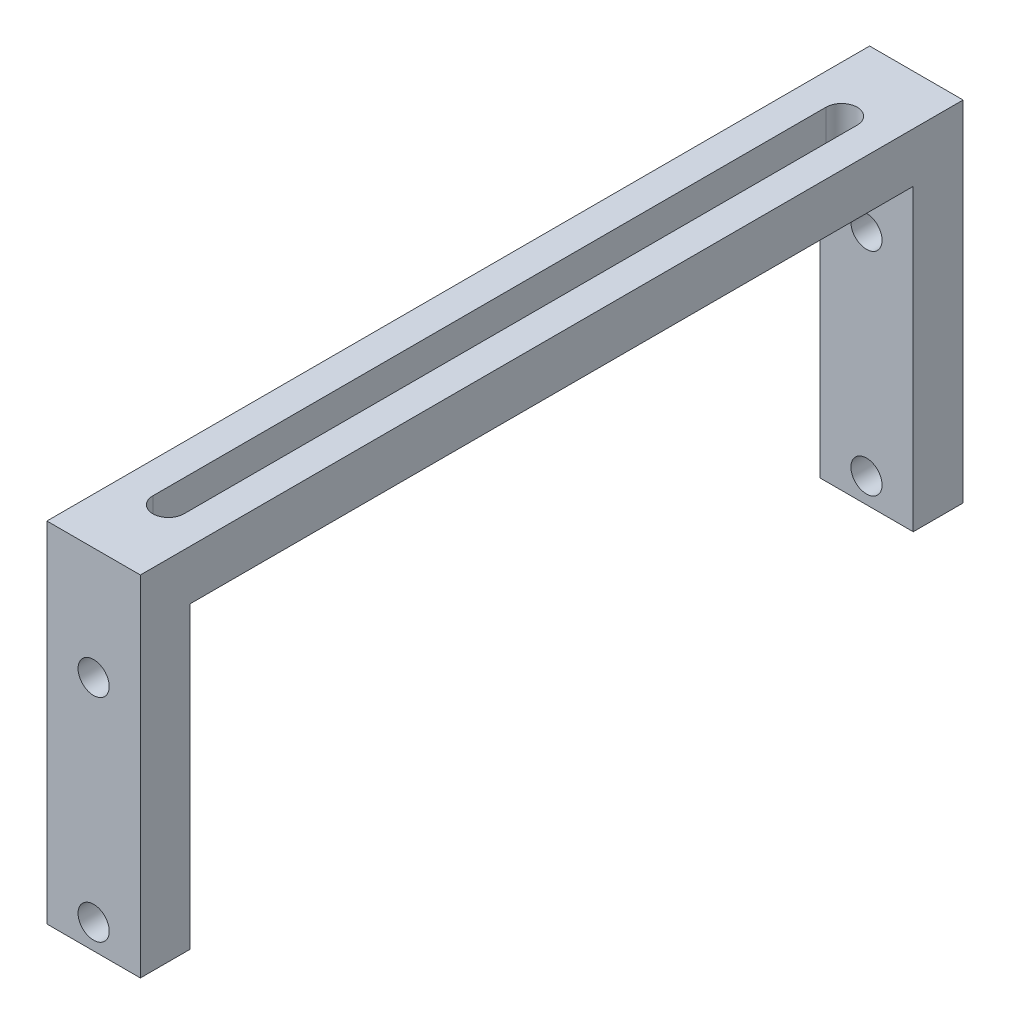
ISO-10303-21;
HEADER;
FILE_DESCRIPTION(('STEP AP214'),'2;1');
FILE_NAME('part.step','',(''),(''),'','','');
FILE_SCHEMA(('AUTOMOTIVE_DESIGN { 1 0 10303 214 1 1 1 1 }'));
ENDSEC;
DATA;
#1=APPLICATION_CONTEXT('core data for automotive mechanical design processes');
#2=APPLICATION_PROTOCOL_DEFINITION('international standard','automotive_design',2000,#1);
#3=PRODUCT_CONTEXT('',#1,'mechanical');
#4=PRODUCT('Part','Part','',(#3));
#5=PRODUCT_RELATED_PRODUCT_CATEGORY('part','',(#4));
#6=PRODUCT_DEFINITION_FORMATION('','',#4);
#7=PRODUCT_DEFINITION_CONTEXT('part definition',#1,'design');
#8=PRODUCT_DEFINITION('design','',#6,#7);
#9=PRODUCT_DEFINITION_SHAPE('','',#8);
#10=(LENGTH_UNIT() NAMED_UNIT(*) SI_UNIT(.MILLI.,.METRE.));
#11=(NAMED_UNIT(*) PLANE_ANGLE_UNIT() SI_UNIT($,.RADIAN.));
#12=(NAMED_UNIT(*) SI_UNIT($,.STERADIAN.) SOLID_ANGLE_UNIT());
#13=UNCERTAINTY_MEASURE_WITH_UNIT(LENGTH_MEASURE(1.E-05),#10,'distance_accuracy_value','');
#14=(GEOMETRIC_REPRESENTATION_CONTEXT(3) GLOBAL_UNCERTAINTY_ASSIGNED_CONTEXT((#13)) GLOBAL_UNIT_ASSIGNED_CONTEXT((#10,
#11,#12)) REPRESENTATION_CONTEXT('',''));
#15=CARTESIAN_POINT('',(0.,0.,0.));
#16=DIRECTION('',(0.,0.,1.));
#17=DIRECTION('',(1.,0.,0.));
#18=AXIS2_PLACEMENT_3D('',#15,#16,#17);
#19=CARTESIAN_POINT('',(4.7625,-17.78,83.82));
#20=DIRECTION('',(0.,1.,0.));
#21=DIRECTION('',(0.,0.,1.));
#22=AXIS2_PLACEMENT_3D('',#19,#20,#21);
#23=PLANE('',#22);
#24=DIRECTION('',(0.,0.,-1.));
#25=VECTOR('',#24,1.);
#26=CARTESIAN_POINT('',(-4.7625,-17.78,83.82));
#27=LINE('',#26,#25);
#28=CARTESIAN_POINT('',(-4.7625,-17.78,83.82));
#29=VERTEX_POINT('',#28);
#30=CARTESIAN_POINT('',(-4.7625,-17.78,78.74));
#31=VERTEX_POINT('',#30);
#32=EDGE_CURVE('E208',#29,#31,#27,.T.);
#33=ORIENTED_EDGE('',*,*,#32,.T.);
#34=DIRECTION('',(1.,0.,0.));
#35=VECTOR('',#34,1.);
#36=CARTESIAN_POINT('',(-73.9775,-17.78,78.74));
#37=LINE('',#36,#35);
#38=CARTESIAN_POINT('',(4.7625,-17.78,78.74));
#39=VERTEX_POINT('',#38);
#40=EDGE_CURVE('E160',#31,#39,#37,.T.);
#41=ORIENTED_EDGE('',*,*,#40,.T.);
#42=DIRECTION('',(0.,0.,-1.));
#43=VECTOR('',#42,1.);
#44=CARTESIAN_POINT('',(4.7625,-17.78,83.82));
#45=LINE('',#44,#43);
#46=CARTESIAN_POINT('',(4.7625,-17.78,83.82));
#47=VERTEX_POINT('',#46);
#48=EDGE_CURVE('E204',#47,#39,#45,.T.);
#49=ORIENTED_EDGE('',*,*,#48,.F.);
#50=DIRECTION('',(1.,0.,0.));
#51=VECTOR('',#50,1.);
#52=CARTESIAN_POINT('',(4.7625,-17.78,83.82));
#53=LINE('',#52,#51);
#54=EDGE_CURVE('E182',#29,#47,#53,.T.);
#55=ORIENTED_EDGE('',*,*,#54,.F.);
#56=EDGE_LOOP('',(#33,#41,#49,#55));
#57=FACE_BOUND('',#56,.T.);
#58=ADVANCED_FACE('F33',(#57),#23,.F.);
#59=CARTESIAN_POINT('',(-4.7625,17.78,83.82));
#60=DIRECTION('',(1.,0.,0.));
#61=DIRECTION('',(0.,1.,0.));
#62=AXIS2_PLACEMENT_3D('',#59,#60,#61);
#63=PLANE('',#62);
#64=DIRECTION('',(0.,0.,1.));
#65=VECTOR('',#64,1.);
#66=CARTESIAN_POINT('',(-4.7625,12.7,83.82));
#67=LINE('',#66,#65);
#68=CARTESIAN_POINT('',(-4.7625,12.7,5.08));
#69=VERTEX_POINT('',#68);
#70=CARTESIAN_POINT('',(-4.7625,12.7,78.74));
#71=VERTEX_POINT('',#70);
#72=EDGE_CURVE('E172',#69,#71,#67,.T.);
#73=ORIENTED_EDGE('',*,*,#72,.T.);
#74=DIRECTION('',(0.,-1.,0.));
#75=VECTOR('',#74,1.);
#76=CARTESIAN_POINT('',(-4.7625,17.78,78.74));
#77=LINE('',#76,#75);
#78=EDGE_CURVE('E175',#71,#31,#77,.T.);
#79=ORIENTED_EDGE('',*,*,#78,.T.);
#80=ORIENTED_EDGE('',*,*,#32,.F.);
#81=DIRECTION('',(0.,-1.,0.));
#82=VECTOR('',#81,1.);
#83=CARTESIAN_POINT('',(-4.7625,17.78,83.82));
#84=LINE('',#83,#82);
#85=CARTESIAN_POINT('',(-4.7625,17.78,83.82));
#86=VERTEX_POINT('',#85);
#87=EDGE_CURVE('E179',#86,#29,#84,.T.);
#88=ORIENTED_EDGE('',*,*,#87,.F.);
#89=DIRECTION('',(0.,0.,-1.));
#90=VECTOR('',#89,1.);
#91=CARTESIAN_POINT('',(-4.7625,17.78,83.82));
#92=LINE('',#91,#90);
#93=CARTESIAN_POINT('',(-4.7625,17.78,0.));
#94=VERTEX_POINT('',#93);
#95=EDGE_CURVE('E189',#86,#94,#92,.T.);
#96=ORIENTED_EDGE('',*,*,#95,.T.);
#97=DIRECTION('',(0.,-1.,0.));
#98=VECTOR('',#97,1.);
#99=CARTESIAN_POINT('',(-4.7625,17.78,0.));
#100=LINE('',#99,#98);
#101=CARTESIAN_POINT('',(-4.7625,-17.78,0.));
#102=VERTEX_POINT('',#101);
#103=EDGE_CURVE('E178',#94,#102,#100,.T.);
#104=ORIENTED_EDGE('',*,*,#103,.T.);
#105=CARTESIAN_POINT('',(-4.7625,-17.78,5.08));
#106=VERTEX_POINT('',#105);
#107=EDGE_CURVE('E207',#106,#102,#27,.T.);
#108=ORIENTED_EDGE('',*,*,#107,.F.);
#109=DIRECTION('',(0.,1.,0.));
#110=VECTOR('',#109,1.);
#111=CARTESIAN_POINT('',(-4.7625,17.78,5.08));
#112=LINE('',#111,#110);
#113=EDGE_CURVE('E163',#106,#69,#112,.T.);
#114=ORIENTED_EDGE('',*,*,#113,.T.);
#115=EDGE_LOOP('',(#73,#79,#80,#88,#96,#104,#108,#114));
#116=FACE_BOUND('',#115,.T.);
#117=ADVANCED_FACE('F35',(#116),#63,.F.);
#118=CARTESIAN_POINT('',(4.7625,-17.78,5.08));
#119=VERTEX_POINT('',#118);
#120=CARTESIAN_POINT('',(4.7625,-17.78,0.));
#121=VERTEX_POINT('',#120);
#122=EDGE_CURVE('E203',#119,#121,#45,.T.);
#123=ORIENTED_EDGE('',*,*,#122,.F.);
#124=DIRECTION('',(1.,0.,0.));
#125=VECTOR('',#124,1.);
#126=CARTESIAN_POINT('',(-73.9775,-17.78,5.08));
#127=LINE('',#126,#125);
#128=EDGE_CURVE('E166',#106,#119,#127,.T.);
#129=ORIENTED_EDGE('',*,*,#128,.F.);
#130=ORIENTED_EDGE('',*,*,#107,.T.);
#131=DIRECTION('',(1.,0.,0.));
#132=VECTOR('',#131,1.);
#133=CARTESIAN_POINT('',(4.7625,-17.78,0.));
#134=LINE('',#133,#132);
#135=EDGE_CURVE('E192',#102,#121,#134,.T.);
#136=ORIENTED_EDGE('',*,*,#135,.T.);
#137=EDGE_LOOP('',(#123,#129,#130,#136));
#138=FACE_BOUND('',#137,.T.);
#139=ADVANCED_FACE('F262',(#138),#23,.F.);
#140=CARTESIAN_POINT('',(4.7625,17.78,83.82));
#141=DIRECTION('',(-1.,0.,0.));
#142=DIRECTION('',(0.,-1.,0.));
#143=AXIS2_PLACEMENT_3D('',#140,#141,#142);
#144=PLANE('',#143);
#145=ORIENTED_EDGE('',*,*,#48,.T.);
#146=DIRECTION('',(0.,-1.,0.));
#147=VECTOR('',#146,1.);
#148=CARTESIAN_POINT('',(4.7625,12.7,78.74));
#149=LINE('',#148,#147);
#150=CARTESIAN_POINT('',(4.7625,12.7,78.74));
#151=VERTEX_POINT('',#150);
#152=EDGE_CURVE('E150',#151,#39,#149,.T.);
#153=ORIENTED_EDGE('',*,*,#152,.F.);
#154=DIRECTION('',(0.,0.,1.));
#155=VECTOR('',#154,1.);
#156=CARTESIAN_POINT('',(4.7625,12.7,78.74));
#157=LINE('',#156,#155);
#158=CARTESIAN_POINT('',(4.7625,12.7,5.08));
#159=VERTEX_POINT('',#158);
#160=EDGE_CURVE('E157',#159,#151,#157,.T.);
#161=ORIENTED_EDGE('',*,*,#160,.F.);
#162=DIRECTION('',(0.,1.,0.));
#163=VECTOR('',#162,1.);
#164=CARTESIAN_POINT('',(4.7625,12.7,5.08));
#165=LINE('',#164,#163);
#166=EDGE_CURVE('E154',#119,#159,#165,.T.);
#167=ORIENTED_EDGE('',*,*,#166,.F.);
#168=ORIENTED_EDGE('',*,*,#122,.T.);
#169=DIRECTION('',(0.,1.,0.));
#170=VECTOR('',#169,1.);
#171=CARTESIAN_POINT('',(4.7625,17.78,0.));
#172=LINE('',#171,#170);
#173=CARTESIAN_POINT('',(4.7625,17.78,0.));
#174=VERTEX_POINT('',#173);
#175=EDGE_CURVE('E195',#121,#174,#172,.T.);
#176=ORIENTED_EDGE('',*,*,#175,.T.);
#177=DIRECTION('',(0.,0.,-1.));
#178=VECTOR('',#177,1.);
#179=CARTESIAN_POINT('',(4.7625,17.78,83.82));
#180=LINE('',#179,#178);
#181=CARTESIAN_POINT('',(4.7625,17.78,83.82));
#182=VERTEX_POINT('',#181);
#183=EDGE_CURVE('E200',#182,#174,#180,.T.);
#184=ORIENTED_EDGE('',*,*,#183,.F.);
#185=DIRECTION('',(0.,1.,0.));
#186=VECTOR('',#185,1.);
#187=CARTESIAN_POINT('',(4.7625,17.78,83.82));
#188=LINE('',#187,#186);
#189=EDGE_CURVE('E185',#47,#182,#188,.T.);
#190=ORIENTED_EDGE('',*,*,#189,.F.);
#191=EDGE_LOOP('',(#145,#153,#161,#167,#168,#176,#184,#190));
#192=FACE_BOUND('',#191,.T.);
#193=ADVANCED_FACE('F269',(#192),#144,.F.);
#194=CARTESIAN_POINT('',(4.7625,17.78,83.82));
#195=DIRECTION('',(0.,-1.,0.));
#196=DIRECTION('',(0.,0.,-1.));
#197=AXIS2_PLACEMENT_3D('',#194,#195,#196);
#198=PLANE('',#197);
#199=DIRECTION('',(0.,0.,-1.));
#200=VECTOR('',#199,1.);
#201=CARTESIAN_POINT('',(1.5875,17.78,7.62));
#202=LINE('',#201,#200);
#203=CARTESIAN_POINT('',(1.58750000000001,17.78,76.2));
#204=VERTEX_POINT('',#203);
#205=CARTESIAN_POINT('',(1.5875,17.78,7.62));
#206=VERTEX_POINT('',#205);
#207=EDGE_CURVE('E136',#204,#206,#202,.T.);
#208=ORIENTED_EDGE('',*,*,#207,.F.);
#209=CARTESIAN_POINT('',(0.,17.78,76.2));
#210=DIRECTION('',(0.,1.,0.));
#211=DIRECTION('',(-1.,0.,0.));
#212=AXIS2_PLACEMENT_3D('',#209,#210,#211);
#213=CIRCLE('',#212,1.5875);
#214=CARTESIAN_POINT('',(-1.5875,17.78,76.2));
#215=VERTEX_POINT('',#214);
#216=EDGE_CURVE('E50',#215,#204,#213,.T.);
#217=ORIENTED_EDGE('',*,*,#216,.F.);
#218=DIRECTION('',(0.,0.,1.));
#219=VECTOR('',#218,1.);
#220=CARTESIAN_POINT('',(-1.5875,17.78,76.2));
#221=LINE('',#220,#219);
#222=CARTESIAN_POINT('',(-1.5875,17.78,7.62));
#223=VERTEX_POINT('',#222);
#224=EDGE_CURVE('E143',#223,#215,#221,.T.);
#225=ORIENTED_EDGE('',*,*,#224,.F.);
#226=CARTESIAN_POINT('',(0.,17.78,7.62));
#227=DIRECTION('',(0.,1.,0.));
#228=DIRECTION('',(1.,0.,0.));
#229=AXIS2_PLACEMENT_3D('',#226,#227,#228);
#230=CIRCLE('',#229,1.5875);
#231=EDGE_CURVE('E127',#206,#223,#230,.T.);
#232=ORIENTED_EDGE('',*,*,#231,.F.);
#233=EDGE_LOOP('',(#208,#217,#225,#232));
#234=FACE_BOUND('',#233,.T.);
#235=DIRECTION('',(-1.,0.,0.));
#236=VECTOR('',#235,1.);
#237=CARTESIAN_POINT('',(4.7625,17.78,0.));
#238=LINE('',#237,#236);
#239=EDGE_CURVE('E183',#174,#94,#238,.T.);
#240=ORIENTED_EDGE('',*,*,#239,.T.);
#241=ORIENTED_EDGE('',*,*,#95,.F.);
#242=DIRECTION('',(-1.,0.,0.));
#243=VECTOR('',#242,1.);
#244=CARTESIAN_POINT('',(4.7625,17.78,83.82));
#245=LINE('',#244,#243);
#246=EDGE_CURVE('E187',#182,#86,#245,.T.);
#247=ORIENTED_EDGE('',*,*,#246,.F.);
#248=ORIENTED_EDGE('',*,*,#183,.T.);
#249=EDGE_LOOP('',(#240,#241,#247,#248));
#250=FACE_BOUND('',#249,.T.);
#251=ADVANCED_FACE('F140',(#234,#250),#198,.F.);
#252=CARTESIAN_POINT('',(0.,0.,83.82));
#253=DIRECTION('',(0.,0.,-1.));
#254=DIRECTION('',(-1.,0.,0.));
#255=AXIS2_PLACEMENT_3D('',#252,#253,#254);
#256=PLANE('',#255);
#257=CARTESIAN_POINT('',(0.,6.34999999999999,83.82));
#258=DIRECTION('',(0.,0.,1.));
#259=DIRECTION('',(1.,0.,0.));
#260=AXIS2_PLACEMENT_3D('',#257,#258,#259);
#261=CIRCLE('',#260,1.5875);
#262=CARTESIAN_POINT('',(1.5875,6.34999999999999,83.82));
#263=VERTEX_POINT('',#262);
#264=EDGE_CURVE('E234',#263,#263,#261,.T.);
#265=ORIENTED_EDGE('',*,*,#264,.F.);
#266=EDGE_LOOP('',(#265));
#267=FACE_BOUND('',#266,.T.);
#268=CARTESIAN_POINT('',(0.,-15.24,83.82));
#269=DIRECTION('',(0.,0.,1.));
#270=DIRECTION('',(1.,0.,0.));
#271=AXIS2_PLACEMENT_3D('',#268,#269,#270);
#272=CIRCLE('',#271,1.5875);
#273=CARTESIAN_POINT('',(1.5875,-15.24,83.82));
#274=VERTEX_POINT('',#273);
#275=EDGE_CURVE('E224',#274,#274,#272,.T.);
#276=ORIENTED_EDGE('',*,*,#275,.F.);
#277=EDGE_LOOP('',(#276));
#278=FACE_BOUND('',#277,.T.);
#279=ORIENTED_EDGE('',*,*,#87,.T.);
#280=ORIENTED_EDGE('',*,*,#54,.T.);
#281=ORIENTED_EDGE('',*,*,#189,.T.);
#282=ORIENTED_EDGE('',*,*,#246,.T.);
#283=EDGE_LOOP('',(#279,#280,#281,#282));
#284=FACE_BOUND('',#283,.T.);
#285=ADVANCED_FACE('F295',(#267,#278,#284),#256,.F.);
#286=CARTESIAN_POINT('',(0.,0.,0.));
#287=DIRECTION('',(0.,0.,-1.));
#288=DIRECTION('',(-1.,0.,0.));
#289=AXIS2_PLACEMENT_3D('',#286,#287,#288);
#290=PLANE('',#289);
#291=CARTESIAN_POINT('',(0.,6.34999999999999,0.));
#292=DIRECTION('',(0.,0.,1.));
#293=DIRECTION('',(1.,0.,0.));
#294=AXIS2_PLACEMENT_3D('',#291,#292,#293);
#295=CIRCLE('',#294,1.5875);
#296=CARTESIAN_POINT('',(1.5875,6.34999999999999,0.));
#297=VERTEX_POINT('',#296);
#298=EDGE_CURVE('E237',#297,#297,#295,.T.);
#299=ORIENTED_EDGE('',*,*,#298,.T.);
#300=EDGE_LOOP('',(#299));
#301=FACE_BOUND('',#300,.T.);
#302=CARTESIAN_POINT('',(0.,-15.24,0.));
#303=DIRECTION('',(0.,0.,1.));
#304=DIRECTION('',(1.,0.,0.));
#305=AXIS2_PLACEMENT_3D('',#302,#303,#304);
#306=CIRCLE('',#305,1.5875);
#307=CARTESIAN_POINT('',(1.5875,-15.24,0.));
#308=VERTEX_POINT('',#307);
#309=EDGE_CURVE('E218',#308,#308,#306,.T.);
#310=ORIENTED_EDGE('',*,*,#309,.T.);
#311=EDGE_LOOP('',(#310));
#312=FACE_BOUND('',#311,.T.);
#313=ORIENTED_EDGE('',*,*,#103,.F.);
#314=ORIENTED_EDGE('',*,*,#239,.F.);
#315=ORIENTED_EDGE('',*,*,#175,.F.);
#316=ORIENTED_EDGE('',*,*,#135,.F.);
#317=EDGE_LOOP('',(#313,#314,#315,#316));
#318=FACE_BOUND('',#317,.T.);
#319=ADVANCED_FACE('F288',(#301,#312,#318),#290,.T.);
#320=CARTESIAN_POINT('',(-73.9775,12.7,78.74));
#321=DIRECTION('',(0.,0.,1.));
#322=DIRECTION('',(1.,0.,0.));
#323=AXIS2_PLACEMENT_3D('',#320,#321,#322);
#324=PLANE('',#323);
#325=CARTESIAN_POINT('',(0.,6.34999999999999,78.74));
#326=DIRECTION('',(0.,0.,1.));
#327=DIRECTION('',(1.,0.,0.));
#328=AXIS2_PLACEMENT_3D('',#325,#326,#327);
#329=CIRCLE('',#328,1.5875);
#330=CARTESIAN_POINT('',(1.5875,6.34999999999999,78.74));
#331=VERTEX_POINT('',#330);
#332=EDGE_CURVE('E229',#331,#331,#329,.T.);
#333=ORIENTED_EDGE('',*,*,#332,.T.);
#334=EDGE_LOOP('',(#333));
#335=FACE_BOUND('',#334,.T.);
#336=CARTESIAN_POINT('',(0.,-15.24,78.74));
#337=DIRECTION('',(0.,0.,1.));
#338=DIRECTION('',(1.,0.,0.));
#339=AXIS2_PLACEMENT_3D('',#336,#337,#338);
#340=CIRCLE('',#339,1.5875);
#341=CARTESIAN_POINT('',(1.5875,-15.24,78.74));
#342=VERTEX_POINT('',#341);
#343=EDGE_CURVE('E217',#342,#342,#340,.T.);
#344=ORIENTED_EDGE('',*,*,#343,.T.);
#345=EDGE_LOOP('',(#344));
#346=FACE_BOUND('',#345,.T.);
#347=DIRECTION('',(1.,0.,0.));
#348=VECTOR('',#347,1.);
#349=CARTESIAN_POINT('',(-73.9775,12.7,78.74));
#350=LINE('',#349,#348);
#351=EDGE_CURVE('E161',#71,#151,#350,.T.);
#352=ORIENTED_EDGE('',*,*,#351,.T.);
#353=ORIENTED_EDGE('',*,*,#152,.T.);
#354=ORIENTED_EDGE('',*,*,#40,.F.);
#355=ORIENTED_EDGE('',*,*,#78,.F.);
#356=EDGE_LOOP('',(#352,#353,#354,#355));
#357=FACE_BOUND('',#356,.T.);
#358=ADVANCED_FACE('F299',(#335,#346,#357),#324,.F.);
#359=CARTESIAN_POINT('',(-73.9775,12.7,78.74));
#360=DIRECTION('',(0.,1.,0.));
#361=DIRECTION('',(-1.,0.,0.));
#362=AXIS2_PLACEMENT_3D('',#359,#360,#361);
#363=PLANE('',#362);
#364=DIRECTION('',(0.,0.,1.));
#365=VECTOR('',#364,1.);
#366=CARTESIAN_POINT('',(-1.58750000000001,12.7,78.74));
#367=LINE('',#366,#365);
#368=CARTESIAN_POINT('',(-1.5875,12.7,7.62));
#369=VERTEX_POINT('',#368);
#370=CARTESIAN_POINT('',(-1.5875,12.7,76.2));
#371=VERTEX_POINT('',#370);
#372=EDGE_CURVE('E42',#369,#371,#367,.T.);
#373=ORIENTED_EDGE('',*,*,#372,.T.);
#374=CARTESIAN_POINT('',(0.,12.7,76.2));
#375=DIRECTION('',(0.,1.,0.));
#376=DIRECTION('',(-1.,0.,0.));
#377=AXIS2_PLACEMENT_3D('',#374,#375,#376);
#378=CIRCLE('',#377,1.5875);
#379=CARTESIAN_POINT('',(1.58750000000001,12.7,76.2));
#380=VERTEX_POINT('',#379);
#381=EDGE_CURVE('E11',#371,#380,#378,.T.);
#382=ORIENTED_EDGE('',*,*,#381,.T.);
#383=DIRECTION('',(0.,0.,-1.));
#384=VECTOR('',#383,1.);
#385=CARTESIAN_POINT('',(1.58750000000002,12.7,78.74));
#386=LINE('',#385,#384);
#387=CARTESIAN_POINT('',(1.58750000000001,12.7,7.62));
#388=VERTEX_POINT('',#387);
#389=EDGE_CURVE('E211',#380,#388,#386,.T.);
#390=ORIENTED_EDGE('',*,*,#389,.T.);
#391=CARTESIAN_POINT('',(0.,12.7,7.62));
#392=DIRECTION('',(0.,1.,0.));
#393=DIRECTION('',(-1.,0.,0.));
#394=AXIS2_PLACEMENT_3D('',#391,#392,#393);
#395=CIRCLE('',#394,1.5875);
#396=EDGE_CURVE('E130',#388,#369,#395,.T.);
#397=ORIENTED_EDGE('',*,*,#396,.T.);
#398=EDGE_LOOP('',(#373,#382,#390,#397));
#399=FACE_BOUND('',#398,.T.);
#400=DIRECTION('',(1.,0.,0.));
#401=VECTOR('',#400,1.);
#402=CARTESIAN_POINT('',(-73.9775,12.7,5.08));
#403=LINE('',#402,#401);
#404=EDGE_CURVE('E164',#69,#159,#403,.T.);
#405=ORIENTED_EDGE('',*,*,#404,.T.);
#406=ORIENTED_EDGE('',*,*,#160,.T.);
#407=ORIENTED_EDGE('',*,*,#351,.F.);
#408=ORIENTED_EDGE('',*,*,#72,.F.);
#409=EDGE_LOOP('',(#405,#406,#407,#408));
#410=FACE_BOUND('',#409,.T.);
#411=ADVANCED_FACE('F302',(#399,#410),#363,.F.);
#412=CARTESIAN_POINT('',(-73.9775,12.7,5.08));
#413=DIRECTION('',(0.,0.,-1.));
#414=DIRECTION('',(-1.,0.,0.));
#415=AXIS2_PLACEMENT_3D('',#412,#413,#414);
#416=PLANE('',#415);
#417=CARTESIAN_POINT('',(0.,6.34999999999999,5.08));
#418=DIRECTION('',(0.,0.,-1.));
#419=DIRECTION('',(-1.,0.,0.));
#420=AXIS2_PLACEMENT_3D('',#417,#418,#419);
#421=CIRCLE('',#420,1.5875);
#422=CARTESIAN_POINT('',(-1.5875,6.34999999999999,5.08));
#423=VERTEX_POINT('',#422);
#424=EDGE_CURVE('E37',#423,#423,#421,.T.);
#425=ORIENTED_EDGE('',*,*,#424,.T.);
#426=EDGE_LOOP('',(#425));
#427=FACE_BOUND('',#426,.T.);
#428=CARTESIAN_POINT('',(0.,-15.24,5.08));
#429=DIRECTION('',(0.,0.,-1.));
#430=DIRECTION('',(-1.,0.,0.));
#431=AXIS2_PLACEMENT_3D('',#428,#429,#430);
#432=CIRCLE('',#431,1.5875);
#433=CARTESIAN_POINT('',(-1.5875,-15.24,5.08));
#434=VERTEX_POINT('',#433);
#435=EDGE_CURVE('E215',#434,#434,#432,.T.);
#436=ORIENTED_EDGE('',*,*,#435,.T.);
#437=EDGE_LOOP('',(#436));
#438=FACE_BOUND('',#437,.T.);
#439=ORIENTED_EDGE('',*,*,#128,.T.);
#440=ORIENTED_EDGE('',*,*,#166,.T.);
#441=ORIENTED_EDGE('',*,*,#404,.F.);
#442=ORIENTED_EDGE('',*,*,#113,.F.);
#443=EDGE_LOOP('',(#439,#440,#441,#442));
#444=FACE_BOUND('',#443,.T.);
#445=ADVANCED_FACE('F244',(#427,#438,#444),#416,.F.);
#446=CARTESIAN_POINT('',(0.,-60.96,76.2));
#447=DIRECTION('',(0.,1.,0.));
#448=DIRECTION('',(-1.,0.,0.));
#449=AXIS2_PLACEMENT_3D('',#446,#447,#448);
#450=CYLINDRICAL_SURFACE('',#449,1.5875);
#451=DIRECTION('',(0.,1.,0.));
#452=VECTOR('',#451,1.);
#453=CARTESIAN_POINT('',(-1.58749999999999,-60.96,76.2));
#454=LINE('',#453,#452);
#455=EDGE_CURVE('E148',#371,#215,#454,.T.);
#456=ORIENTED_EDGE('',*,*,#455,.T.);
#457=ORIENTED_EDGE('',*,*,#216,.T.);
#458=DIRECTION('',(0.,1.,0.));
#459=VECTOR('',#458,1.);
#460=CARTESIAN_POINT('',(1.58750000000002,-60.96,76.2));
#461=LINE('',#460,#459);
#462=EDGE_CURVE('E133',#380,#204,#461,.T.);
#463=ORIENTED_EDGE('',*,*,#462,.F.);
#464=ORIENTED_EDGE('',*,*,#381,.F.);
#465=EDGE_LOOP('',(#456,#457,#463,#464));
#466=FACE_BOUND('',#465,.T.);
#467=ADVANCED_FACE('F311',(#466),#450,.F.);
#468=CARTESIAN_POINT('',(-1.58749999999999,-60.96,76.2));
#469=DIRECTION('',(-1.,0.,0.));
#470=DIRECTION('',(0.,-1.,0.));
#471=AXIS2_PLACEMENT_3D('',#468,#469,#470);
#472=PLANE('',#471);
#473=DIRECTION('',(0.,1.,0.));
#474=VECTOR('',#473,1.);
#475=CARTESIAN_POINT('',(-1.58749999999999,-60.96,7.62));
#476=LINE('',#475,#474);
#477=EDGE_CURVE('E132',#369,#223,#476,.T.);
#478=ORIENTED_EDGE('',*,*,#477,.T.);
#479=ORIENTED_EDGE('',*,*,#224,.T.);
#480=ORIENTED_EDGE('',*,*,#455,.F.);
#481=ORIENTED_EDGE('',*,*,#372,.F.);
#482=EDGE_LOOP('',(#478,#479,#480,#481));
#483=FACE_BOUND('',#482,.T.);
#484=ADVANCED_FACE('F388',(#483),#472,.F.);
#485=CARTESIAN_POINT('',(0.,-60.96,7.62));
#486=DIRECTION('',(0.,1.,0.));
#487=DIRECTION('',(-1.,0.,0.));
#488=AXIS2_PLACEMENT_3D('',#485,#486,#487);
#489=CYLINDRICAL_SURFACE('',#488,1.5875);
#490=DIRECTION('',(0.,1.,0.));
#491=VECTOR('',#490,1.);
#492=CARTESIAN_POINT('',(1.58750000000001,-60.96,7.62));
#493=LINE('',#492,#491);
#494=EDGE_CURVE('E58',#388,#206,#493,.T.);
#495=ORIENTED_EDGE('',*,*,#494,.T.);
#496=ORIENTED_EDGE('',*,*,#231,.T.);
#497=ORIENTED_EDGE('',*,*,#477,.F.);
#498=ORIENTED_EDGE('',*,*,#396,.F.);
#499=EDGE_LOOP('',(#495,#496,#497,#498));
#500=FACE_BOUND('',#499,.T.);
#501=ADVANCED_FACE('F124',(#500),#489,.F.);
#502=CARTESIAN_POINT('',(1.58750000000001,-60.96,7.62));
#503=DIRECTION('',(1.,0.,0.));
#504=DIRECTION('',(0.,1.,0.));
#505=AXIS2_PLACEMENT_3D('',#502,#503,#504);
#506=PLANE('',#505);
#507=ORIENTED_EDGE('',*,*,#462,.T.);
#508=ORIENTED_EDGE('',*,*,#207,.T.);
#509=ORIENTED_EDGE('',*,*,#494,.F.);
#510=ORIENTED_EDGE('',*,*,#389,.F.);
#511=EDGE_LOOP('',(#507,#508,#509,#510));
#512=FACE_BOUND('',#511,.T.);
#513=ADVANCED_FACE('F137',(#512),#506,.F.);
#514=CARTESIAN_POINT('',(0.,-15.24,0.));
#515=DIRECTION('',(0.,0.,1.));
#516=DIRECTION('',(1.,0.,0.));
#517=AXIS2_PLACEMENT_3D('',#514,#515,#516);
#518=CYLINDRICAL_SURFACE('',#517,1.5875);
#519=ORIENTED_EDGE('',*,*,#309,.F.);
#520=EDGE_LOOP('',(#519));
#521=FACE_BOUND('',#520,.T.);
#522=ORIENTED_EDGE('',*,*,#435,.F.);
#523=EDGE_LOOP('',(#522));
#524=FACE_BOUND('',#523,.T.);
#525=ADVANCED_FACE('F257',(#521,#524),#518,.F.);
#526=ORIENTED_EDGE('',*,*,#275,.T.);
#527=EDGE_LOOP('',(#526));
#528=FACE_BOUND('',#527,.T.);
#529=ORIENTED_EDGE('',*,*,#343,.F.);
#530=EDGE_LOOP('',(#529));
#531=FACE_BOUND('',#530,.T.);
#532=ADVANCED_FACE('F249',(#528,#531),#518,.F.);
#533=CARTESIAN_POINT('',(0.,6.34999999999999,0.));
#534=DIRECTION('',(0.,0.,1.));
#535=DIRECTION('',(1.,0.,0.));
#536=AXIS2_PLACEMENT_3D('',#533,#534,#535);
#537=CYLINDRICAL_SURFACE('',#536,1.5875);
#538=ORIENTED_EDGE('',*,*,#298,.F.);
#539=EDGE_LOOP('',(#538));
#540=FACE_BOUND('',#539,.T.);
#541=ORIENTED_EDGE('',*,*,#424,.F.);
#542=EDGE_LOOP('',(#541));
#543=FACE_BOUND('',#542,.T.);
#544=ADVANCED_FACE('F246',(#540,#543),#537,.F.);
#545=ORIENTED_EDGE('',*,*,#264,.T.);
#546=EDGE_LOOP('',(#545));
#547=FACE_BOUND('',#546,.T.);
#548=ORIENTED_EDGE('',*,*,#332,.F.);
#549=EDGE_LOOP('',(#548));
#550=FACE_BOUND('',#549,.T.);
#551=ADVANCED_FACE('F248',(#547,#550),#537,.F.);
#552=CLOSED_SHELL('',(#58,#117,#139,#193,#251,#285,#319,#358,#411,#445,#467,#484,#501,#513,#525,
#532,#544,#551));
#553=MANIFOLD_SOLID_BREP('B2',#552);
#554=ADVANCED_BREP_SHAPE_REPRESENTATION('',(#18,#553),#14);
#555=SHAPE_DEFINITION_REPRESENTATION(#9,#554);
ENDSEC;
END-ISO-10303-21;
